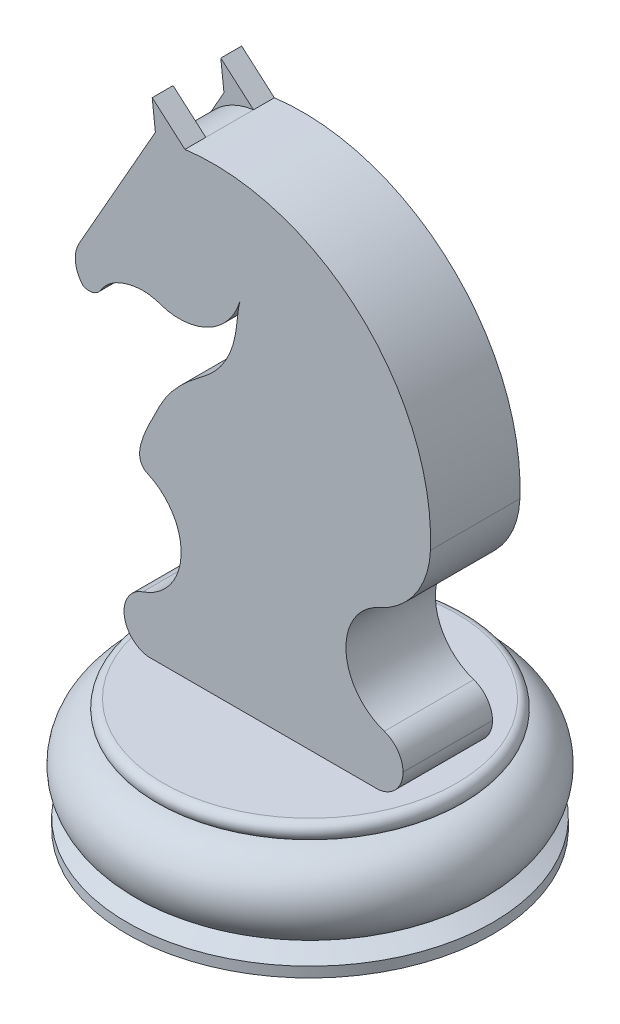
ISO-10303-21;
HEADER;
FILE_DESCRIPTION(('STEP AP214'),'2;1');
FILE_NAME('part.step','',(''),(''),'','','');
FILE_SCHEMA(('AUTOMOTIVE_DESIGN { 1 0 10303 214 1 1 1 1 }'));
ENDSEC;
DATA;
#1=APPLICATION_CONTEXT('core data for automotive mechanical design processes');
#2=APPLICATION_PROTOCOL_DEFINITION('international standard','automotive_design',2000,#1);
#3=PRODUCT_CONTEXT('',#1,'mechanical');
#4=PRODUCT('Part','Part','',(#3));
#5=PRODUCT_RELATED_PRODUCT_CATEGORY('part','',(#4));
#6=PRODUCT_DEFINITION_FORMATION('','',#4);
#7=PRODUCT_DEFINITION_CONTEXT('part definition',#1,'design');
#8=PRODUCT_DEFINITION('design','',#6,#7);
#9=PRODUCT_DEFINITION_SHAPE('','',#8);
#10=(LENGTH_UNIT() NAMED_UNIT(*) SI_UNIT(.MILLI.,.METRE.));
#11=(NAMED_UNIT(*) PLANE_ANGLE_UNIT() SI_UNIT($,.RADIAN.));
#12=(NAMED_UNIT(*) SI_UNIT($,.STERADIAN.) SOLID_ANGLE_UNIT());
#13=UNCERTAINTY_MEASURE_WITH_UNIT(LENGTH_MEASURE(1.E-05),#10,'distance_accuracy_value','');
#14=(GEOMETRIC_REPRESENTATION_CONTEXT(3) GLOBAL_UNCERTAINTY_ASSIGNED_CONTEXT((#13)) GLOBAL_UNIT_ASSIGNED_CONTEXT((#10,
#11,#12)) REPRESENTATION_CONTEXT('',''));
#15=CARTESIAN_POINT('',(0.,0.,0.));
#16=DIRECTION('',(0.,0.,1.));
#17=DIRECTION('',(1.,0.,0.));
#18=AXIS2_PLACEMENT_3D('',#15,#16,#17);
#19=CARTESIAN_POINT('',(-6.33453149086693,-9.76887763521636,3.8099981885137));
#20=DIRECTION('',(0.,0.,1.));
#21=DIRECTION('',(1.,0.,0.));
#22=AXIS2_PLACEMENT_3D('',#19,#20,#21);
#23=PLANE('',#22);
#24=CARTESIAN_POINT('',(-3.50659731221939,-7.43207763521636,3.8099981885137));
#25=DIRECTION('',(0.,0.,1.));
#26=DIRECTION('',(1.,0.,0.));
#27=AXIS2_PLACEMENT_3D('',#24,#25,#26);
#28=CIRCLE('',#27,2.3368);
#29=CARTESIAN_POINT('',(-5.84339731221939,-7.43207763521636,3.8099981885137));
#30=VERTEX_POINT('',#29);
#31=CARTESIAN_POINT('',(-3.77337090500808,-9.7536,3.8099981885137));
#32=VERTEX_POINT('',#31);
#33=EDGE_CURVE('E225',#30,#32,#28,.T.);
#34=ORIENTED_EDGE('',*,*,#33,.T.);
#35=DIRECTION('',(1.,0.,0.));
#36=VECTOR('',#35,1.);
#37=CARTESIAN_POINT('',(-6.33453149086693,-9.7536,3.8099981885137));
#38=LINE('',#37,#36);
#39=CARTESIAN_POINT('',(15.8487178428069,-9.7536,3.8099981885137));
#40=VERTEX_POINT('',#39);
#41=EDGE_CURVE('E54',#32,#40,#38,.T.);
#42=ORIENTED_EDGE('',*,*,#41,.T.);
#43=CARTESIAN_POINT('',(15.5819442500182,-7.43207763521637,3.8099981885137));
#44=DIRECTION('',(0.,0.,1.));
#45=DIRECTION('',(1.,0.,0.));
#46=AXIS2_PLACEMENT_3D('',#43,#44,#45);
#47=CIRCLE('',#46,2.3368);
#48=CARTESIAN_POINT('',(17.9187442500182,-7.43207763521637,3.8099981885137));
#49=VERTEX_POINT('',#48);
#50=EDGE_CURVE('E228',#40,#49,#47,.T.);
#51=ORIENTED_EDGE('',*,*,#50,.T.);
#52=DIRECTION('',(0.,-1.,0.));
#53=VECTOR('',#52,1.);
#54=CARTESIAN_POINT('',(17.9187442500182,-9.76887763521636,3.8099981885137));
#55=LINE('',#54,#53);
#56=CARTESIAN_POINT('',(17.9187442500182,-7.41737637676181,3.8099981885137));
#57=VERTEX_POINT('',#56);
#58=EDGE_CURVE('E416',#57,#49,#55,.T.);
#59=ORIENTED_EDGE('',*,*,#58,.F.);
#60=CARTESIAN_POINT('',(15.5819442500182,-7.41737637676181,3.8099981885137));
#61=DIRECTION('',(0.,0.,1.));
#62=DIRECTION('',(1.,0.,0.));
#63=AXIS2_PLACEMENT_3D('',#60,#61,#62);
#64=CIRCLE('',#63,2.3368);
#65=CARTESIAN_POINT('',(16.3236122403076,-5.20139739848153,3.8099981885137));
#66=VERTEX_POINT('',#65);
#67=EDGE_CURVE('E61',#57,#66,#64,.T.);
#68=ORIENTED_EDGE('',*,*,#67,.T.);
#69=CARTESIAN_POINT('',(17.8433961404727,-0.66053919994882,3.8099981885137));
#70=DIRECTION('',(0.,0.,1.));
#71=DIRECTION('',(1.,0.,0.));
#72=AXIS2_PLACEMENT_3D('',#69,#70,#71);
#73=CIRCLE('',#72,4.7884377705451);
#74=CARTESIAN_POINT('',(15.9068794115736,3.7188487985136,3.8099981885137));
#75=VERTEX_POINT('',#74);
#76=EDGE_CURVE('E419',#75,#66,#73,.T.);
#77=ORIENTED_EDGE('',*,*,#76,.F.);
#78=CARTESIAN_POINT('',(12.9491420458794,10.4077037557791,3.8099981885137));
#79=DIRECTION('',(0.,0.,1.));
#80=DIRECTION('',(1.,0.,0.));
#81=AXIS2_PLACEMENT_3D('',#78,#79,#80);
#82=CIRCLE('',#81,7.31361681822054);
#83=CARTESIAN_POINT('',(20.2569241723652,10.115622678725,3.8099981885137));
#84=VERTEX_POINT('',#83);
#85=EDGE_CURVE('E276',#75,#84,#82,.T.);
#86=ORIENTED_EDGE('',*,*,#85,.T.);
#87=CARTESIAN_POINT('',(1.73998635555858,10.8557168752493,3.8099981885137));
#88=DIRECTION('',(0.,0.,1.));
#89=DIRECTION('',(1.,0.,0.));
#90=AXIS2_PLACEMENT_3D('',#87,#88,#89);
#91=CIRCLE('',#90,18.5317221415392);
#92=CARTESIAN_POINT('',(-0.659397845841418,29.2314530777879,3.8099981885137));
#93=VERTEX_POINT('',#92);
#94=EDGE_CURVE('E488',#84,#93,#91,.T.);
#95=ORIENTED_EDGE('',*,*,#94,.T.);
#96=DIRECTION('',(0.754371000372789,-0.656448317688878,0.));
#97=VECTOR('',#96,1.);
#98=CARTESIAN_POINT('',(15.424203195965,15.2356170222457,3.8099981885137));
#99=LINE('',#98,#97);
#100=CARTESIAN_POINT('',(-3.44575324010753,31.6561198666032,3.8099981885137));
#101=VERTEX_POINT('',#100);
#102=EDGE_CURVE('E390',#101,#93,#99,.T.);
#103=ORIENTED_EDGE('',*,*,#102,.F.);
#104=DIRECTION('',(-0.110652575715223,0.993859148716551,0.));
#105=VECTOR('',#104,1.);
#106=CARTESIAN_POINT('',(1.07451092548524,-8.94398244960438,3.8099981885137));
#107=LINE('',#106,#105);
#108=CARTESIAN_POINT('',(-3.17597399240266,29.2330169995231,3.8099981885137));
#109=VERTEX_POINT('',#108);
#110=EDGE_CURVE('E392',#109,#101,#107,.T.);
#111=ORIENTED_EDGE('',*,*,#110,.F.);
#112=DIRECTION('',(-0.49379733980778,-0.869577016254892,0.));
#113=VECTOR('',#112,1.);
#114=CARTESIAN_POINT('',(-20.6933548516595,-1.61508717641833,3.8099981885137));
#115=LINE('',#114,#113);
#116=CARTESIAN_POINT('',(-9.6665667032036,17.8030845390098,3.8099981885137));
#117=VERTEX_POINT('',#116);
#118=EDGE_CURVE('E795',#109,#117,#115,.T.);
#119=ORIENTED_EDGE('',*,*,#118,.T.);
#120=CARTESIAN_POINT('',(-7.45784108191618,16.5488392958981,3.8099981885137));
#121=DIRECTION('',(0.,0.,1.));
#122=DIRECTION('',(1.,0.,0.));
#123=AXIS2_PLACEMENT_3D('',#120,#121,#122);
#124=CIRCLE('',#123,2.54);
#125=CARTESIAN_POINT('',(-9.34660634828971,14.8505561132277,3.8099981885137));
#126=VERTEX_POINT('',#125);
#127=EDGE_CURVE('E471',#117,#126,#124,.T.);
#128=ORIENTED_EDGE('',*,*,#127,.T.);
#129=CARTESIAN_POINT('',(-8.80866678794483,15.8359433472275,3.8099981885137));
#130=DIRECTION('',(0.,0.,1.));
#131=DIRECTION('',(1.,0.,0.));
#132=AXIS2_PLACEMENT_3D('',#129,#130,#131);
#133=CIRCLE('',#132,1.1226606662361);
#134=CARTESIAN_POINT('',(-7.85351560724268,15.245983015072,3.8099981885137));
#135=VERTEX_POINT('',#134);
#136=EDGE_CURVE('E446',#126,#135,#133,.T.);
#137=ORIENTED_EDGE('',*,*,#136,.T.);
#138=CARTESIAN_POINT('',(-2.14506856348728,16.5854049943185,3.8099981885137));
#139=CARTESIAN_POINT('',(-3.28798796014853,16.9835188620566,3.8099981885137));
#140=CARTESIAN_POINT('',(-4.47320990910234,17.1770517987488,3.8099981885137));
#141=CARTESIAN_POINT('',(-6.69690390961328,16.5653731211122,3.8099981885137));
#142=CARTESIAN_POINT('',(-7.57829909101477,15.6666016366963,3.8099981885137));
#143=CARTESIAN_POINT('',(-7.85351560724268,15.245983015072,3.8099981885137));
#144=B_SPLINE_CURVE_WITH_KNOTS('',3,(#138,#139,#140,#141,#142,#143),.UNSPECIFIED.,.F.,.F.,(4,1,
1,4),(0.,0.420129132468444,0.756704517434695,1.),.UNSPECIFIED.);
#145=CARTESIAN_POINT('',(-2.14506856348728,16.5854049943185,3.8099981885137));
#146=VERTEX_POINT('',#145);
#147=EDGE_CURVE('E281',#146,#135,#144,.T.);
#148=ORIENTED_EDGE('',*,*,#147,.F.);
#149=CARTESIAN_POINT('',(-1.16136412184366,21.9081442049396,3.8099981885137));
#150=DIRECTION('',(0.,0.,1.));
#151=DIRECTION('',(1.,0.,0.));
#152=AXIS2_PLACEMENT_3D('',#149,#150,#151);
#153=CIRCLE('',#152,5.41287605001198);
#154=CARTESIAN_POINT('',(4.03413064956451,20.3895721081778,3.8099981885137));
#155=VERTEX_POINT('',#154);
#156=EDGE_CURVE('E287',#146,#155,#153,.T.);
#157=ORIENTED_EDGE('',*,*,#156,.T.);
#158=CARTESIAN_POINT('',(4.03413064956451,20.3895721081778,3.8099981885137));
#159=CARTESIAN_POINT('',(3.82597931671066,19.6733321363585,3.8099981885137));
#160=CARTESIAN_POINT('',(3.78993160385629,18.0173628837938,3.8099981885137));
#161=CARTESIAN_POINT('',(3.14407513275843,15.7355854540321,3.8099981885137));
#162=CARTESIAN_POINT('',(1.80400348675601,13.8748530141868,3.8099981885137));
#163=CARTESIAN_POINT('',(-0.268432878015737,12.4439881665125,3.8099981885137));
#164=CARTESIAN_POINT('',(-2.18167142394436,10.5284495627718,3.8099981885137));
#165=CARTESIAN_POINT('',(-3.50693723533912,7.83245563451061,3.8099981885137));
#166=CARTESIAN_POINT('',(-5.25642056989235,4.34891848768243,3.8099981885137));
#167=CARTESIAN_POINT('',(-3.83153247377478,3.71884879851359,3.8099981885137));
#168=B_SPLINE_CURVE_WITH_KNOTS('',3,(#158,#159,#160,#161,#162,#163,#164,#165,#166,#167),
.UNSPECIFIED.,.F.,.F.,(4,1,1,1,1,1,1,4),(0.,0.124569175441424,0.243621952632296,
0.370064102740452,0.470537717841571,0.638822979124148,0.769534636035511,1.),.UNSPECIFIED.);
#169=CARTESIAN_POINT('',(-3.83153247377477,3.71884879851359,3.8099981885137));
#170=VERTEX_POINT('',#169);
#171=EDGE_CURVE('E251',#155,#170,#168,.T.);
#172=ORIENTED_EDGE('',*,*,#171,.T.);
#173=CARTESIAN_POINT('',(-5.76804920267394,-0.660539199948825,3.8099981885137));
#174=DIRECTION('',(0.,0.,1.));
#175=DIRECTION('',(1.,0.,0.));
#176=AXIS2_PLACEMENT_3D('',#173,#174,#175);
#177=CIRCLE('',#176,4.78843777054511);
#178=CARTESIAN_POINT('',(-4.24826530250877,-5.20139739848154,3.8099981885137));
#179=VERTEX_POINT('',#178);
#180=EDGE_CURVE('E243',#170,#179,#177,.F.);
#181=ORIENTED_EDGE('',*,*,#180,.T.);
#182=CARTESIAN_POINT('',(-3.50659731221939,-7.41737637676182,3.8099981885137));
#183=DIRECTION('',(0.,0.,1.));
#184=DIRECTION('',(1.,0.,0.));
#185=AXIS2_PLACEMENT_3D('',#182,#183,#184);
#186=CIRCLE('',#185,2.3368);
#187=CARTESIAN_POINT('',(-5.84339731221939,-7.41737637676182,3.8099981885137));
#188=VERTEX_POINT('',#187);
#189=EDGE_CURVE('E223',#179,#188,#186,.T.);
#190=ORIENTED_EDGE('',*,*,#189,.T.);
#191=DIRECTION('',(0.,-1.,0.));
#192=VECTOR('',#191,1.);
#193=CARTESIAN_POINT('',(-5.84339731221939,-9.76887763521636,3.8099981885137));
#194=LINE('',#193,#192);
#195=EDGE_CURVE('E253',#188,#30,#194,.T.);
#196=ORIENTED_EDGE('',*,*,#195,.T.);
#197=EDGE_LOOP('',(#34,#42,#51,#59,#68,#77,#86,#95,#103,#111,#119,#128,#137,#148,#157,#172,#181,
#190,#196));
#198=FACE_BOUND('',#197,.T.);
#199=ADVANCED_FACE('F39',(#198),#23,.T.);
#200=CARTESIAN_POINT('',(-6.33453149086693,-9.76887763521636,-3.8100018114863));
#201=DIRECTION('',(0.,0.,1.));
#202=DIRECTION('',(1.,0.,0.));
#203=AXIS2_PLACEMENT_3D('',#200,#201,#202);
#204=PLANE('',#203);
#205=DIRECTION('',(1.,0.,0.));
#206=VECTOR('',#205,1.);
#207=CARTESIAN_POINT('',(-6.33453149086693,-9.7536,-3.8100018114863));
#208=LINE('',#207,#206);
#209=CARTESIAN_POINT('',(-3.77337090500808,-9.7536,-3.8100018114863));
#210=VERTEX_POINT('',#209);
#211=CARTESIAN_POINT('',(15.8487178428069,-9.7536,-3.8100018114863));
#212=VERTEX_POINT('',#211);
#213=EDGE_CURVE('E195',#210,#212,#208,.T.);
#214=ORIENTED_EDGE('',*,*,#213,.F.);
#215=CARTESIAN_POINT('',(-3.50659731221939,-7.43207763521636,-3.8100018114863));
#216=DIRECTION('',(0.,0.,1.));
#217=DIRECTION('',(1.,0.,0.));
#218=AXIS2_PLACEMENT_3D('',#215,#216,#217);
#219=CIRCLE('',#218,2.3368);
#220=CARTESIAN_POINT('',(-5.84339731221939,-7.43207763521636,-3.8100018114863));
#221=VERTEX_POINT('',#220);
#222=EDGE_CURVE('E205',#210,#221,#219,.F.);
#223=ORIENTED_EDGE('',*,*,#222,.T.);
#224=DIRECTION('',(0.,-1.,0.));
#225=VECTOR('',#224,1.);
#226=CARTESIAN_POINT('',(-5.84339731221939,-9.76887763521636,-3.8100018114863));
#227=LINE('',#226,#225);
#228=CARTESIAN_POINT('',(-5.84339731221939,-7.41737637676182,-3.8100018114863));
#229=VERTEX_POINT('',#228);
#230=EDGE_CURVE('E258',#229,#221,#227,.T.);
#231=ORIENTED_EDGE('',*,*,#230,.F.);
#232=CARTESIAN_POINT('',(-3.50659731221939,-7.41737637676182,-3.8100018114863));
#233=DIRECTION('',(0.,0.,1.));
#234=DIRECTION('',(1.,0.,0.));
#235=AXIS2_PLACEMENT_3D('',#232,#233,#234);
#236=CIRCLE('',#235,2.3368);
#237=CARTESIAN_POINT('',(-4.24826530250877,-5.20139739848154,-3.8100018114863));
#238=VERTEX_POINT('',#237);
#239=EDGE_CURVE('E215',#229,#238,#236,.F.);
#240=ORIENTED_EDGE('',*,*,#239,.T.);
#241=CARTESIAN_POINT('',(-5.76804920267394,-0.660539199948825,-3.8100018114863));
#242=DIRECTION('',(0.,0.,1.));
#243=DIRECTION('',(1.,0.,0.));
#244=AXIS2_PLACEMENT_3D('',#241,#242,#243);
#245=CIRCLE('',#244,4.78843777054511);
#246=CARTESIAN_POINT('',(-3.83153247377477,3.71884879851359,-3.8100018114863));
#247=VERTEX_POINT('',#246);
#248=EDGE_CURVE('E245',#247,#238,#245,.F.);
#249=ORIENTED_EDGE('',*,*,#248,.F.);
#250=CARTESIAN_POINT('',(4.03413064956451,20.3895721081778,-3.8100018114863));
#251=CARTESIAN_POINT('',(3.82597931671066,19.6733321363585,-3.8100018114863));
#252=CARTESIAN_POINT('',(3.78993160385629,18.0173628837938,-3.8100018114863));
#253=CARTESIAN_POINT('',(3.14407513275843,15.7355854540321,-3.8100018114863));
#254=CARTESIAN_POINT('',(1.80400348675601,13.8748530141868,-3.8100018114863));
#255=CARTESIAN_POINT('',(-0.268432878015737,12.4439881665125,-3.8100018114863));
#256=CARTESIAN_POINT('',(-2.18167142394436,10.5284495627718,-3.8100018114863));
#257=CARTESIAN_POINT('',(-3.50693723533912,7.83245563451061,-3.8100018114863));
#258=CARTESIAN_POINT('',(-5.25642056989235,4.34891848768243,-3.8100018114863));
#259=CARTESIAN_POINT('',(-3.83153247377478,3.71884879851359,-3.8100018114863));
#260=B_SPLINE_CURVE_WITH_KNOTS('',3,(#250,#251,#252,#253,#254,#255,#256,#257,#258,#259),
.UNSPECIFIED.,.F.,.F.,(4,1,1,1,1,1,1,4),(0.,0.124569175441424,0.243621952632296,
0.370064102740452,0.470537717841571,0.638822979124148,0.769534636035511,1.),.UNSPECIFIED.);
#261=CARTESIAN_POINT('',(4.03413064956451,20.3895721081778,-3.8100018114863));
#262=VERTEX_POINT('',#261);
#263=EDGE_CURVE('E263',#262,#247,#260,.T.);
#264=ORIENTED_EDGE('',*,*,#263,.F.);
#265=CARTESIAN_POINT('',(-1.16136412184366,21.9081442049396,-3.8100018114863));
#266=DIRECTION('',(0.,0.,1.));
#267=DIRECTION('',(1.,0.,0.));
#268=AXIS2_PLACEMENT_3D('',#265,#266,#267);
#269=CIRCLE('',#268,5.41287605001198);
#270=CARTESIAN_POINT('',(-2.14506856348728,16.5854049943185,-3.8100018114863));
#271=VERTEX_POINT('',#270);
#272=EDGE_CURVE('E356',#271,#262,#269,.T.);
#273=ORIENTED_EDGE('',*,*,#272,.F.);
#274=CARTESIAN_POINT('',(-2.14506856348728,16.5854049943185,-3.8100018114863));
#275=CARTESIAN_POINT('',(-3.28798796014853,16.9835188620566,-3.8100018114863));
#276=CARTESIAN_POINT('',(-4.47320990910234,17.1770517987488,-3.8100018114863));
#277=CARTESIAN_POINT('',(-6.69690390961328,16.5653731211122,-3.8100018114863));
#278=CARTESIAN_POINT('',(-7.57829909101477,15.6666016366963,-3.8100018114863));
#279=CARTESIAN_POINT('',(-7.85351560724268,15.245983015072,-3.8100018114863));
#280=B_SPLINE_CURVE_WITH_KNOTS('',3,(#274,#275,#276,#277,#278,#279),.UNSPECIFIED.,.F.,.F.,(4,1,
1,4),(0.,0.420129132468444,0.756704517434695,1.),.UNSPECIFIED.);
#281=CARTESIAN_POINT('',(-7.85351560724268,15.245983015072,-3.8100018114863));
#282=VERTEX_POINT('',#281);
#283=EDGE_CURVE('E280',#271,#282,#280,.T.);
#284=ORIENTED_EDGE('',*,*,#283,.T.);
#285=CARTESIAN_POINT('',(-8.80866678794483,15.8359433472275,-3.8100018114863));
#286=DIRECTION('',(0.,0.,1.));
#287=DIRECTION('',(1.,0.,0.));
#288=AXIS2_PLACEMENT_3D('',#285,#286,#287);
#289=CIRCLE('',#288,1.1226606662361);
#290=CARTESIAN_POINT('',(-9.34660634828971,14.8505561132277,-3.8100018114863));
#291=VERTEX_POINT('',#290);
#292=EDGE_CURVE('E288',#291,#282,#289,.T.);
#293=ORIENTED_EDGE('',*,*,#292,.F.);
#294=CARTESIAN_POINT('',(-7.45784108191618,16.5488392958981,-3.8100018114863));
#295=DIRECTION('',(0.,0.,1.));
#296=DIRECTION('',(1.,0.,0.));
#297=AXIS2_PLACEMENT_3D('',#294,#295,#296);
#298=CIRCLE('',#297,2.54);
#299=CARTESIAN_POINT('',(-9.66656670320359,17.8030845390098,-3.8100018114863));
#300=VERTEX_POINT('',#299);
#301=EDGE_CURVE('E467',#291,#300,#298,.F.);
#302=ORIENTED_EDGE('',*,*,#301,.T.);
#303=DIRECTION('',(-0.49379733980778,-0.869577016254892,0.));
#304=VECTOR('',#303,1.);
#305=CARTESIAN_POINT('',(-20.6933548516595,-1.61508717641833,-3.8100018114863));
#306=LINE('',#305,#304);
#307=CARTESIAN_POINT('',(-3.17597399240266,29.2330169995231,-3.8100018114863));
#308=VERTEX_POINT('',#307);
#309=EDGE_CURVE('E355',#308,#300,#306,.T.);
#310=ORIENTED_EDGE('',*,*,#309,.F.);
#311=DIRECTION('',(0.110652575715223,-0.993859148716551,0.));
#312=VECTOR('',#311,1.);
#313=CARTESIAN_POINT('',(-3.17597399240266,29.2330169995231,-3.8100018114863));
#314=LINE('',#313,#312);
#315=CARTESIAN_POINT('',(-3.44575324010753,31.6561198666032,-3.8100018114863));
#316=VERTEX_POINT('',#315);
#317=EDGE_CURVE('E367',#316,#308,#314,.T.);
#318=ORIENTED_EDGE('',*,*,#317,.F.);
#319=DIRECTION('',(-0.754371000372789,0.656448317688878,0.));
#320=VECTOR('',#319,1.);
#321=CARTESIAN_POINT('',(-3.44575324010753,31.6561198666032,-3.8100018114863));
#322=LINE('',#321,#320);
#323=CARTESIAN_POINT('',(-0.659397845841418,29.2314530777879,-3.8100018114863));
#324=VERTEX_POINT('',#323);
#325=EDGE_CURVE('E362',#324,#316,#322,.T.);
#326=ORIENTED_EDGE('',*,*,#325,.F.);
#327=CARTESIAN_POINT('',(1.73998635555858,10.8557168752493,-3.8100018114863));
#328=DIRECTION('',(0.,0.,1.));
#329=DIRECTION('',(1.,0.,0.));
#330=AXIS2_PLACEMENT_3D('',#327,#328,#329);
#331=CIRCLE('',#330,18.5317221415392);
#332=CARTESIAN_POINT('',(20.2569241723652,10.115622678725,-3.8100018114863));
#333=VERTEX_POINT('',#332);
#334=EDGE_CURVE('E347',#333,#324,#331,.T.);
#335=ORIENTED_EDGE('',*,*,#334,.F.);
#336=CARTESIAN_POINT('',(12.9491420458794,10.4077037557791,-3.8100018114863));
#337=DIRECTION('',(0.,0.,1.));
#338=DIRECTION('',(1.,0.,0.));
#339=AXIS2_PLACEMENT_3D('',#336,#337,#338);
#340=CIRCLE('',#339,7.31361681822054);
#341=CARTESIAN_POINT('',(15.9068794115736,3.7188487985136,-3.8100018114863));
#342=VERTEX_POINT('',#341);
#343=EDGE_CURVE('E269',#342,#333,#340,.T.);
#344=ORIENTED_EDGE('',*,*,#343,.F.);
#345=CARTESIAN_POINT('',(17.8433961404727,-0.66053919994882,-3.8100018114863));
#346=DIRECTION('',(0.,0.,1.));
#347=DIRECTION('',(1.,0.,0.));
#348=AXIS2_PLACEMENT_3D('',#345,#346,#347);
#349=CIRCLE('',#348,4.7884377705451);
#350=CARTESIAN_POINT('',(16.3236122403076,-5.20139739848153,-3.8100018114863));
#351=VERTEX_POINT('',#350);
#352=EDGE_CURVE('E261',#342,#351,#349,.T.);
#353=ORIENTED_EDGE('',*,*,#352,.T.);
#354=CARTESIAN_POINT('',(15.5819442500182,-7.41737637676181,-3.8100018114863));
#355=DIRECTION('',(0.,0.,1.));
#356=DIRECTION('',(1.,0.,0.));
#357=AXIS2_PLACEMENT_3D('',#354,#355,#356);
#358=CIRCLE('',#357,2.3368);
#359=CARTESIAN_POINT('',(17.9187442500182,-7.41737637676181,-3.8100018114863));
#360=VERTEX_POINT('',#359);
#361=EDGE_CURVE('E214',#351,#360,#358,.F.);
#362=ORIENTED_EDGE('',*,*,#361,.T.);
#363=DIRECTION('',(0.,-1.,0.));
#364=VECTOR('',#363,1.);
#365=CARTESIAN_POINT('',(17.9187442500182,-9.76887763521636,-3.8100018114863));
#366=LINE('',#365,#364);
#367=CARTESIAN_POINT('',(17.9187442500182,-7.43207763521637,-3.8100018114863));
#368=VERTEX_POINT('',#367);
#369=EDGE_CURVE('E259',#360,#368,#366,.T.);
#370=ORIENTED_EDGE('',*,*,#369,.T.);
#371=CARTESIAN_POINT('',(15.5819442500182,-7.43207763521637,-3.8100018114863));
#372=DIRECTION('',(0.,0.,1.));
#373=DIRECTION('',(1.,0.,0.));
#374=AXIS2_PLACEMENT_3D('',#371,#372,#373);
#375=CIRCLE('',#374,2.3368);
#376=EDGE_CURVE('E208',#368,#212,#375,.F.);
#377=ORIENTED_EDGE('',*,*,#376,.T.);
#378=EDGE_LOOP('',(#214,#223,#231,#240,#249,#264,#273,#284,#293,#302,#310,#318,#326,#335,#344,
#353,#362,#370,#377));
#379=FACE_BOUND('',#378,.T.);
#380=ADVANCED_FACE('F203',(#379),#204,.F.);
#381=CARTESIAN_POINT('',(15.5819442500182,-7.43207763521637,3.8099981885137));
#382=DIRECTION('',(0.,0.,1.));
#383=DIRECTION('',(1.,0.,0.));
#384=AXIS2_PLACEMENT_3D('',#381,#382,#383);
#385=CYLINDRICAL_SURFACE('',#384,2.3368);
#386=ORIENTED_EDGE('',*,*,#50,.F.);
#387=DIRECTION('',(0.,0.,1.));
#388=VECTOR('',#387,1.);
#389=CARTESIAN_POINT('',(15.8487178428069,-9.7536,3.8099981885137));
#390=LINE('',#389,#388);
#391=EDGE_CURVE('E378',#40,#212,#390,.F.);
#392=ORIENTED_EDGE('',*,*,#391,.T.);
#393=ORIENTED_EDGE('',*,*,#376,.F.);
#394=DIRECTION('',(0.,0.,-1.));
#395=VECTOR('',#394,1.);
#396=CARTESIAN_POINT('',(17.9187442500182,-7.43207763521637,-3.8100018114863));
#397=LINE('',#396,#395);
#398=EDGE_CURVE('E218',#49,#368,#397,.T.);
#399=ORIENTED_EDGE('',*,*,#398,.F.);
#400=EDGE_LOOP('',(#386,#392,#393,#399));
#401=FACE_BOUND('',#400,.T.);
#402=ADVANCED_FACE('F308',(#401),#385,.T.);
#403=CARTESIAN_POINT('',(-3.50659731221939,-7.43207763521636,3.8099981885137));
#404=DIRECTION('',(0.,0.,-1.));
#405=DIRECTION('',(-1.,0.,0.));
#406=AXIS2_PLACEMENT_3D('',#403,#404,#405);
#407=CYLINDRICAL_SURFACE('',#406,2.3368);
#408=ORIENTED_EDGE('',*,*,#222,.F.);
#409=DIRECTION('',(0.,0.,-1.));
#410=VECTOR('',#409,1.);
#411=CARTESIAN_POINT('',(-3.77337090500808,-9.7536,3.8099981885137));
#412=LINE('',#411,#410);
#413=EDGE_CURVE('E11',#210,#32,#412,.F.);
#414=ORIENTED_EDGE('',*,*,#413,.T.);
#415=ORIENTED_EDGE('',*,*,#33,.F.);
#416=DIRECTION('',(0.,0.,-1.));
#417=VECTOR('',#416,1.);
#418=CARTESIAN_POINT('',(-5.84339731221939,-7.43207763521636,3.8099981885137));
#419=LINE('',#418,#417);
#420=EDGE_CURVE('E213',#221,#30,#419,.F.);
#421=ORIENTED_EDGE('',*,*,#420,.F.);
#422=EDGE_LOOP('',(#408,#414,#415,#421));
#423=FACE_BOUND('',#422,.T.);
#424=ADVANCED_FACE('F212',(#423),#407,.T.);
#425=CARTESIAN_POINT('',(0.0793191794338424,23.5739726389062,3.8099981885137));
#426=DIRECTION('',(0.,0.,-1.));
#427=DIRECTION('',(-1.,0.,0.));
#428=AXIS2_PLACEMENT_3D('',#425,#426,#427);
#429=CYLINDRICAL_SURFACE('',#428,5.70550503985055);
#430=DIRECTION('',(0.,0.,-1.));
#431=VECTOR('',#430,1.);
#432=CARTESIAN_POINT('',(-0.659397845841418,29.2314530777879,3.8099981885137));
#433=LINE('',#432,#431);
#434=CARTESIAN_POINT('',(-0.659397845841418,29.2314530777879,2.0319981885137));
#435=VERTEX_POINT('',#434);
#436=CARTESIAN_POINT('',(-0.659397845841418,29.2314530777879,-2.03200181148629));
#437=VERTEX_POINT('',#436);
#438=EDGE_CURVE('E462',#435,#437,#433,.T.);
#439=ORIENTED_EDGE('',*,*,#438,.T.);
#440=CARTESIAN_POINT('',(0.0793191794338424,23.5739726389062,-2.0320018114863));
#441=DIRECTION('',(0.,0.,-1.));
#442=DIRECTION('',(1.,0.,0.));
#443=AXIS2_PLACEMENT_3D('',#440,#441,#442);
#444=CIRCLE('',#443,5.70550503985055);
#445=CARTESIAN_POINT('',(-4.34100322784567,27.1814007498272,-2.03200181148629));
#446=VERTEX_POINT('',#445);
#447=EDGE_CURVE('E381',#446,#437,#444,.T.);
#448=ORIENTED_EDGE('',*,*,#447,.F.);
#449=DIRECTION('',(0.,0.,-1.));
#450=VECTOR('',#449,1.);
#451=CARTESIAN_POINT('',(-4.34100322784567,27.1814007498272,3.8099981885137));
#452=LINE('',#451,#450);
#453=CARTESIAN_POINT('',(-4.34100322784567,27.1814007498272,2.0319981885137));
#454=VERTEX_POINT('',#453);
#455=EDGE_CURVE('E459',#454,#446,#452,.T.);
#456=ORIENTED_EDGE('',*,*,#455,.F.);
#457=CARTESIAN_POINT('',(0.0793191794338424,23.5739726389062,2.0319981885137));
#458=DIRECTION('',(0.,0.,1.));
#459=DIRECTION('',(1.,0.,0.));
#460=AXIS2_PLACEMENT_3D('',#457,#458,#459);
#461=CIRCLE('',#460,5.70550503985055);
#462=EDGE_CURVE('E388',#435,#454,#461,.T.);
#463=ORIENTED_EDGE('',*,*,#462,.F.);
#464=EDGE_LOOP('',(#439,#448,#456,#463));
#465=FACE_BOUND('',#464,.T.);
#466=ADVANCED_FACE('F299',(#465),#429,.T.);
#467=DIRECTION('',(0.,0.,-1.));
#468=VECTOR('',#467,1.);
#469=SURFACE_OF_LINEAR_EXTRUSION('',#144,#468);
#470=ORIENTED_EDGE('',*,*,#283,.F.);
#471=DIRECTION('',(0.,0.,-1.));
#472=VECTOR('',#471,1.);
#473=CARTESIAN_POINT('',(-2.14506856348728,16.5854049943185,3.8099981885137));
#474=LINE('',#473,#472);
#475=EDGE_CURVE('E437',#146,#271,#474,.T.);
#476=ORIENTED_EDGE('',*,*,#475,.F.);
#477=ORIENTED_EDGE('',*,*,#147,.T.);
#478=DIRECTION('',(0.,0.,-1.));
#479=VECTOR('',#478,1.);
#480=CARTESIAN_POINT('',(-7.85351560724268,15.245983015072,3.8099981885137));
#481=LINE('',#480,#479);
#482=EDGE_CURVE('E440',#135,#282,#481,.T.);
#483=ORIENTED_EDGE('',*,*,#482,.T.);
#484=EDGE_LOOP('',(#470,#476,#477,#483));
#485=FACE_BOUND('',#484,.T.);
#486=ADVANCED_FACE('F294',(#485),#469,.T.);
#487=CARTESIAN_POINT('',(-1.16136412184366,21.9081442049396,3.8099981885137));
#488=DIRECTION('',(0.,0.,-1.));
#489=DIRECTION('',(-1.,0.,0.));
#490=AXIS2_PLACEMENT_3D('',#487,#488,#489);
#491=CYLINDRICAL_SURFACE('',#490,5.41287605001198);
#492=ORIENTED_EDGE('',*,*,#272,.T.);
#493=DIRECTION('',(0.,0.,-1.));
#494=VECTOR('',#493,1.);
#495=CARTESIAN_POINT('',(4.03413064956451,20.3895721081778,3.8099981885137));
#496=LINE('',#495,#494);
#497=EDGE_CURVE('E431',#155,#262,#496,.T.);
#498=ORIENTED_EDGE('',*,*,#497,.F.);
#499=ORIENTED_EDGE('',*,*,#156,.F.);
#500=ORIENTED_EDGE('',*,*,#475,.T.);
#501=EDGE_LOOP('',(#492,#498,#499,#500));
#502=FACE_BOUND('',#501,.T.);
#503=ADVANCED_FACE('F298',(#502),#491,.T.);
#504=CARTESIAN_POINT('',(1.73998635555858,10.8557168752493,3.8099981885137));
#505=DIRECTION('',(0.,0.,-1.));
#506=DIRECTION('',(-1.,0.,0.));
#507=AXIS2_PLACEMENT_3D('',#504,#505,#506);
#508=CYLINDRICAL_SURFACE('',#507,18.5317221415392);
#509=ORIENTED_EDGE('',*,*,#334,.T.);
#510=DIRECTION('',(0.,0.,1.));
#511=VECTOR('',#510,1.);
#512=CARTESIAN_POINT('',(-0.65939784584142,29.2314530777879,-3.8100018114863));
#513=LINE('',#512,#511);
#514=EDGE_CURVE('E350',#324,#437,#513,.T.);
#515=ORIENTED_EDGE('',*,*,#514,.T.);
#516=ORIENTED_EDGE('',*,*,#438,.F.);
#517=EDGE_CURVE('E463',#93,#435,#433,.T.);
#518=ORIENTED_EDGE('',*,*,#517,.F.);
#519=ORIENTED_EDGE('',*,*,#94,.F.);
#520=DIRECTION('',(0.,0.,-1.));
#521=VECTOR('',#520,1.);
#522=CARTESIAN_POINT('',(20.2569241723652,10.115622678725,3.8099981885137));
#523=LINE('',#522,#521);
#524=EDGE_CURVE('E272',#84,#333,#523,.T.);
#525=ORIENTED_EDGE('',*,*,#524,.T.);
#526=EDGE_LOOP('',(#509,#515,#516,#518,#519,#525));
#527=FACE_BOUND('',#526,.T.);
#528=ADVANCED_FACE('F339',(#527),#508,.T.);
#529=CARTESIAN_POINT('',(-20.6933548516595,-1.61508717641833,3.8099981885137));
#530=DIRECTION('',(0.869577016254892,-0.49379733980778,0.));
#531=DIRECTION('',(0.49379733980778,0.869577016254892,0.));
#532=AXIS2_PLACEMENT_3D('',#529,#530,#531);
#533=PLANE('',#532);
#534=ORIENTED_EDGE('',*,*,#309,.T.);
#535=DIRECTION('',(0.,0.,-1.));
#536=VECTOR('',#535,1.);
#537=CARTESIAN_POINT('',(-9.6665667032036,17.8030845390098,3.8099981885137));
#538=LINE('',#537,#536);
#539=EDGE_CURVE('E469',#300,#117,#538,.F.);
#540=ORIENTED_EDGE('',*,*,#539,.T.);
#541=ORIENTED_EDGE('',*,*,#118,.F.);
#542=DIRECTION('',(0.,0.,-1.));
#543=VECTOR('',#542,1.);
#544=CARTESIAN_POINT('',(-3.17597399240266,29.2330169995231,3.8099981885137));
#545=LINE('',#544,#543);
#546=CARTESIAN_POINT('',(-3.17597399240266,29.2330169995231,2.0319981885137));
#547=VERTEX_POINT('',#546);
#548=EDGE_CURVE('E396',#109,#547,#545,.T.);
#549=ORIENTED_EDGE('',*,*,#548,.T.);
#550=DIRECTION('',(-0.49379733980778,-0.869577016254892,0.));
#551=VECTOR('',#550,1.);
#552=CARTESIAN_POINT('',(-20.6933548516595,-1.61508717641833,2.0319981885137));
#553=LINE('',#552,#551);
#554=EDGE_CURVE('E393',#547,#454,#553,.T.);
#555=ORIENTED_EDGE('',*,*,#554,.T.);
#556=ORIENTED_EDGE('',*,*,#455,.T.);
#557=DIRECTION('',(-0.493797339807782,-0.86957701625489,0.));
#558=VECTOR('',#557,1.);
#559=CARTESIAN_POINT('',(-3.17597399240266,29.2330169995231,-2.0320018114863));
#560=LINE('',#559,#558);
#561=CARTESIAN_POINT('',(-3.17597399240266,29.2330169995231,-2.0320018114863));
#562=VERTEX_POINT('',#561);
#563=EDGE_CURVE('E371',#562,#446,#560,.T.);
#564=ORIENTED_EDGE('',*,*,#563,.F.);
#565=DIRECTION('',(0.,0.,1.));
#566=VECTOR('',#565,1.);
#567=CARTESIAN_POINT('',(-3.17597399240266,29.2330169995231,-3.8100018114863));
#568=LINE('',#567,#566);
#569=EDGE_CURVE('E386',#308,#562,#568,.T.);
#570=ORIENTED_EDGE('',*,*,#569,.F.);
#571=EDGE_LOOP('',(#534,#540,#541,#549,#555,#556,#564,#570));
#572=FACE_BOUND('',#571,.T.);
#573=ADVANCED_FACE('F336',(#572),#533,.F.);
#574=CARTESIAN_POINT('',(-8.80866678794483,15.8359433472275,3.8099981885137));
#575=DIRECTION('',(0.,0.,-1.));
#576=DIRECTION('',(-1.,0.,0.));
#577=AXIS2_PLACEMENT_3D('',#574,#575,#576);
#578=CYLINDRICAL_SURFACE('',#577,1.1226606662361);
#579=ORIENTED_EDGE('',*,*,#292,.T.);
#580=ORIENTED_EDGE('',*,*,#482,.F.);
#581=ORIENTED_EDGE('',*,*,#136,.F.);
#582=DIRECTION('',(0.,0.,-1.));
#583=VECTOR('',#582,1.);
#584=CARTESIAN_POINT('',(-9.34660634828971,14.8505561132277,3.8099981885137));
#585=LINE('',#584,#583);
#586=EDGE_CURVE('E456',#126,#291,#585,.T.);
#587=ORIENTED_EDGE('',*,*,#586,.T.);
#588=EDGE_LOOP('',(#579,#580,#581,#587));
#589=FACE_BOUND('',#588,.T.);
#590=ADVANCED_FACE('F333',(#589),#578,.T.);
#591=DIRECTION('',(0.,0.,-1.));
#592=VECTOR('',#591,1.);
#593=SURFACE_OF_LINEAR_EXTRUSION('',#168,#592);
#594=ORIENTED_EDGE('',*,*,#263,.T.);
#595=DIRECTION('',(0.,0.,-1.));
#596=VECTOR('',#595,1.);
#597=CARTESIAN_POINT('',(-3.83153247377477,3.71884879851359,3.8099981885137));
#598=LINE('',#597,#596);
#599=EDGE_CURVE('E278',#170,#247,#598,.T.);
#600=ORIENTED_EDGE('',*,*,#599,.F.);
#601=ORIENTED_EDGE('',*,*,#171,.F.);
#602=ORIENTED_EDGE('',*,*,#497,.T.);
#603=EDGE_LOOP('',(#594,#600,#601,#602));
#604=FACE_BOUND('',#603,.T.);
#605=ADVANCED_FACE('F329',(#604),#593,.F.);
#606=CARTESIAN_POINT('',(-5.76804920267394,-0.660539199948825,3.8099981885137));
#607=DIRECTION('',(0.,0.,-1.));
#608=DIRECTION('',(-1.,0.,0.));
#609=AXIS2_PLACEMENT_3D('',#606,#607,#608);
#610=CYLINDRICAL_SURFACE('',#609,4.78843777054511);
#611=ORIENTED_EDGE('',*,*,#248,.T.);
#612=DIRECTION('',(0.,0.,-1.));
#613=VECTOR('',#612,1.);
#614=CARTESIAN_POINT('',(-4.24826530250877,-5.20139739848154,3.8099981885137));
#615=LINE('',#614,#613);
#616=EDGE_CURVE('E47',#238,#179,#615,.F.);
#617=ORIENTED_EDGE('',*,*,#616,.T.);
#618=ORIENTED_EDGE('',*,*,#180,.F.);
#619=ORIENTED_EDGE('',*,*,#599,.T.);
#620=EDGE_LOOP('',(#611,#617,#618,#619));
#621=FACE_BOUND('',#620,.T.);
#622=ADVANCED_FACE('F241',(#621),#610,.F.);
#623=CARTESIAN_POINT('',(-5.84339731221939,-9.76887763521636,3.8099981885137));
#624=DIRECTION('',(1.,0.,0.));
#625=DIRECTION('',(0.,0.,-1.));
#626=AXIS2_PLACEMENT_3D('',#623,#624,#625);
#627=PLANE('',#626);
#628=ORIENTED_EDGE('',*,*,#230,.T.);
#629=ORIENTED_EDGE('',*,*,#420,.T.);
#630=ORIENTED_EDGE('',*,*,#195,.F.);
#631=DIRECTION('',(0.,0.,-1.));
#632=VECTOR('',#631,1.);
#633=CARTESIAN_POINT('',(-5.84339731221939,-7.41737637676182,3.8099981885137));
#634=LINE('',#633,#632);
#635=EDGE_CURVE('E233',#188,#229,#634,.T.);
#636=ORIENTED_EDGE('',*,*,#635,.T.);
#637=EDGE_LOOP('',(#628,#629,#630,#636));
#638=FACE_BOUND('',#637,.T.);
#639=ADVANCED_FACE('F257',(#638),#627,.F.);
#640=CARTESIAN_POINT('',(17.9187442500182,-9.76887763521636,3.8099981885137));
#641=DIRECTION('',(1.,0.,0.));
#642=DIRECTION('',(0.,0.,-1.));
#643=AXIS2_PLACEMENT_3D('',#640,#641,#642);
#644=PLANE('',#643);
#645=ORIENTED_EDGE('',*,*,#58,.T.);
#646=ORIENTED_EDGE('',*,*,#398,.T.);
#647=ORIENTED_EDGE('',*,*,#369,.F.);
#648=DIRECTION('',(0.,0.,-1.));
#649=VECTOR('',#648,1.);
#650=CARTESIAN_POINT('',(17.9187442500182,-7.41737637676181,3.8099981885137));
#651=LINE('',#650,#649);
#652=EDGE_CURVE('E473',#360,#57,#651,.F.);
#653=ORIENTED_EDGE('',*,*,#652,.T.);
#654=EDGE_LOOP('',(#645,#646,#647,#653));
#655=FACE_BOUND('',#654,.T.);
#656=ADVANCED_FACE('F478',(#655),#644,.T.);
#657=CARTESIAN_POINT('',(17.8433961404727,-0.66053919994882,3.8099981885137));
#658=DIRECTION('',(0.,0.,-1.));
#659=DIRECTION('',(-1.,0.,0.));
#660=AXIS2_PLACEMENT_3D('',#657,#658,#659);
#661=CYLINDRICAL_SURFACE('',#660,4.7884377705451);
#662=ORIENTED_EDGE('',*,*,#76,.T.);
#663=DIRECTION('',(0.,0.,-1.));
#664=VECTOR('',#663,1.);
#665=CARTESIAN_POINT('',(16.3236122403076,-5.20139739848153,3.8099981885137));
#666=LINE('',#665,#664);
#667=EDGE_CURVE('E230',#66,#351,#666,.T.);
#668=ORIENTED_EDGE('',*,*,#667,.T.);
#669=ORIENTED_EDGE('',*,*,#352,.F.);
#670=DIRECTION('',(0.,0.,-1.));
#671=VECTOR('',#670,1.);
#672=CARTESIAN_POINT('',(15.9068794115736,3.7188487985136,3.8099981885137));
#673=LINE('',#672,#671);
#674=EDGE_CURVE('E275',#75,#342,#673,.T.);
#675=ORIENTED_EDGE('',*,*,#674,.F.);
#676=EDGE_LOOP('',(#662,#668,#669,#675));
#677=FACE_BOUND('',#676,.T.);
#678=ADVANCED_FACE('F484',(#677),#661,.F.);
#679=CARTESIAN_POINT('',(12.9491420458794,10.4077037557791,3.8099981885137));
#680=DIRECTION('',(0.,0.,-1.));
#681=DIRECTION('',(-1.,0.,0.));
#682=AXIS2_PLACEMENT_3D('',#679,#680,#681);
#683=CYLINDRICAL_SURFACE('',#682,7.31361681822054);
#684=ORIENTED_EDGE('',*,*,#343,.T.);
#685=ORIENTED_EDGE('',*,*,#524,.F.);
#686=ORIENTED_EDGE('',*,*,#85,.F.);
#687=ORIENTED_EDGE('',*,*,#674,.T.);
#688=EDGE_LOOP('',(#684,#685,#686,#687));
#689=FACE_BOUND('',#688,.T.);
#690=ADVANCED_FACE('F306',(#689),#683,.T.);
#691=CARTESIAN_POINT('',(-7.45784108191618,16.5488392958981,3.8099981885137));
#692=DIRECTION('',(0.,0.,-1.));
#693=DIRECTION('',(-1.,0.,0.));
#694=AXIS2_PLACEMENT_3D('',#691,#692,#693);
#695=CYLINDRICAL_SURFACE('',#694,2.54);
#696=ORIENTED_EDGE('',*,*,#127,.F.);
#697=ORIENTED_EDGE('',*,*,#539,.F.);
#698=ORIENTED_EDGE('',*,*,#301,.F.);
#699=ORIENTED_EDGE('',*,*,#586,.F.);
#700=EDGE_LOOP('',(#696,#697,#698,#699));
#701=FACE_BOUND('',#700,.T.);
#702=ADVANCED_FACE('F302',(#701),#695,.T.);
#703=CARTESIAN_POINT('',(15.424203195965,15.2356170222457,3.8099981885137));
#704=DIRECTION('',(0.656448317688878,0.754371000372789,0.));
#705=DIRECTION('',(-0.754371000372789,0.656448317688878,0.));
#706=AXIS2_PLACEMENT_3D('',#703,#704,#705);
#707=PLANE('',#706);
#708=DIRECTION('',(0.754371000372789,-0.656448317688878,0.));
#709=VECTOR('',#708,1.);
#710=CARTESIAN_POINT('',(15.424203195965,15.2356170222457,2.0319981885137));
#711=LINE('',#710,#709);
#712=CARTESIAN_POINT('',(-3.44575324010753,31.6561198666032,2.0319981885137));
#713=VERTEX_POINT('',#712);
#714=EDGE_CURVE('E399',#713,#435,#711,.T.);
#715=ORIENTED_EDGE('',*,*,#714,.F.);
#716=DIRECTION('',(0.,0.,-1.));
#717=VECTOR('',#716,1.);
#718=CARTESIAN_POINT('',(-3.44575324010753,31.6561198666032,3.8099981885137));
#719=LINE('',#718,#717);
#720=EDGE_CURVE('E407',#101,#713,#719,.T.);
#721=ORIENTED_EDGE('',*,*,#720,.F.);
#722=ORIENTED_EDGE('',*,*,#102,.T.);
#723=ORIENTED_EDGE('',*,*,#517,.T.);
#724=EDGE_LOOP('',(#715,#721,#722,#723));
#725=FACE_BOUND('',#724,.T.);
#726=ADVANCED_FACE('F305',(#725),#707,.T.);
#727=CARTESIAN_POINT('',(1.07451092548524,-8.94398244960438,3.8099981885137));
#728=DIRECTION('',(-0.993859148716551,-0.110652575715223,0.));
#729=DIRECTION('',(0.110652575715223,-0.993859148716551,0.));
#730=AXIS2_PLACEMENT_3D('',#727,#728,#729);
#731=PLANE('',#730);
#732=DIRECTION('',(-0.110652575715223,0.993859148716551,0.));
#733=VECTOR('',#732,1.);
#734=CARTESIAN_POINT('',(1.07451092548524,-8.94398244960438,2.0319981885137));
#735=LINE('',#734,#733);
#736=EDGE_CURVE('E402',#547,#713,#735,.T.);
#737=ORIENTED_EDGE('',*,*,#736,.F.);
#738=ORIENTED_EDGE('',*,*,#548,.F.);
#739=ORIENTED_EDGE('',*,*,#110,.T.);
#740=ORIENTED_EDGE('',*,*,#720,.T.);
#741=EDGE_LOOP('',(#737,#738,#739,#740));
#742=FACE_BOUND('',#741,.T.);
#743=ADVANCED_FACE('F563',(#742),#731,.T.);
#744=CARTESIAN_POINT('',(-6.33453149086693,-9.76887763521636,2.0319981885137));
#745=DIRECTION('',(0.,0.,1.));
#746=DIRECTION('',(1.,0.,0.));
#747=AXIS2_PLACEMENT_3D('',#744,#745,#746);
#748=PLANE('',#747);
#749=ORIENTED_EDGE('',*,*,#462,.T.);
#750=ORIENTED_EDGE('',*,*,#554,.F.);
#751=ORIENTED_EDGE('',*,*,#736,.T.);
#752=ORIENTED_EDGE('',*,*,#714,.T.);
#753=EDGE_LOOP('',(#749,#750,#751,#752));
#754=FACE_BOUND('',#753,.T.);
#755=ADVANCED_FACE('F570',(#754),#748,.F.);
#756=CARTESIAN_POINT('',(-3.17597399240266,29.2330169995231,-3.8100018114863));
#757=DIRECTION('',(-0.993859148716551,-0.110652575715223,0.));
#758=DIRECTION('',(0.110652575715223,-0.993859148716551,0.));
#759=AXIS2_PLACEMENT_3D('',#756,#757,#758);
#760=PLANE('',#759);
#761=DIRECTION('',(0.110652575715223,-0.993859148716551,0.));
#762=VECTOR('',#761,1.);
#763=CARTESIAN_POINT('',(-3.17597399240266,29.2330169995231,-2.0320018114863));
#764=LINE('',#763,#762);
#765=CARTESIAN_POINT('',(-3.44575324010753,31.6561198666032,-2.0320018114863));
#766=VERTEX_POINT('',#765);
#767=EDGE_CURVE('E375',#766,#562,#764,.T.);
#768=ORIENTED_EDGE('',*,*,#767,.F.);
#769=DIRECTION('',(0.,0.,1.));
#770=VECTOR('',#769,1.);
#771=CARTESIAN_POINT('',(-3.44575324010753,31.6561198666032,-3.8100018114863));
#772=LINE('',#771,#770);
#773=EDGE_CURVE('E366',#316,#766,#772,.T.);
#774=ORIENTED_EDGE('',*,*,#773,.F.);
#775=ORIENTED_EDGE('',*,*,#317,.T.);
#776=ORIENTED_EDGE('',*,*,#569,.T.);
#777=EDGE_LOOP('',(#768,#774,#775,#776));
#778=FACE_BOUND('',#777,.T.);
#779=ADVANCED_FACE('F577',(#778),#760,.T.);
#780=CARTESIAN_POINT('',(-3.44575324010753,31.6561198666032,-3.8100018114863));
#781=DIRECTION('',(0.656448317688878,0.754371000372788,0.));
#782=DIRECTION('',(-0.754371000372789,0.656448317688878,0.));
#783=AXIS2_PLACEMENT_3D('',#780,#781,#782);
#784=PLANE('',#783);
#785=DIRECTION('',(-0.754371000372789,0.656448317688878,0.));
#786=VECTOR('',#785,1.);
#787=CARTESIAN_POINT('',(-3.44575324010753,31.6561198666032,-2.0320018114863));
#788=LINE('',#787,#786);
#789=EDGE_CURVE('E364',#437,#766,#788,.T.);
#790=ORIENTED_EDGE('',*,*,#789,.F.);
#791=ORIENTED_EDGE('',*,*,#514,.F.);
#792=ORIENTED_EDGE('',*,*,#325,.T.);
#793=ORIENTED_EDGE('',*,*,#773,.T.);
#794=EDGE_LOOP('',(#790,#791,#792,#793));
#795=FACE_BOUND('',#794,.T.);
#796=ADVANCED_FACE('F361',(#795),#784,.T.);
#797=CARTESIAN_POINT('',(0.0793191794338424,23.5739726389062,-2.0320018114863));
#798=DIRECTION('',(0.,0.,1.));
#799=DIRECTION('',(1.,0.,0.));
#800=AXIS2_PLACEMENT_3D('',#797,#798,#799);
#801=PLANE('',#800);
#802=ORIENTED_EDGE('',*,*,#447,.T.);
#803=ORIENTED_EDGE('',*,*,#789,.T.);
#804=ORIENTED_EDGE('',*,*,#767,.T.);
#805=ORIENTED_EDGE('',*,*,#563,.T.);
#806=EDGE_LOOP('',(#802,#803,#804,#805));
#807=FACE_BOUND('',#806,.T.);
#808=ADVANCED_FACE('F314',(#807),#801,.T.);
#809=CARTESIAN_POINT('',(15.5819442500182,-7.41737637676181,3.8099981885137));
#810=DIRECTION('',(0.,0.,-1.));
#811=DIRECTION('',(-1.,0.,0.));
#812=AXIS2_PLACEMENT_3D('',#809,#810,#811);
#813=CYLINDRICAL_SURFACE('',#812,2.3368);
#814=ORIENTED_EDGE('',*,*,#67,.F.);
#815=ORIENTED_EDGE('',*,*,#652,.F.);
#816=ORIENTED_EDGE('',*,*,#361,.F.);
#817=ORIENTED_EDGE('',*,*,#667,.F.);
#818=EDGE_LOOP('',(#814,#815,#816,#817));
#819=FACE_BOUND('',#818,.T.);
#820=ADVANCED_FACE('F312',(#819),#813,.T.);
#821=CARTESIAN_POINT('',(-3.50659731221939,-7.41737637676182,3.8099981885137));
#822=DIRECTION('',(0.,0.,-1.));
#823=DIRECTION('',(-1.,0.,0.));
#824=AXIS2_PLACEMENT_3D('',#821,#822,#823);
#825=CYLINDRICAL_SURFACE('',#824,2.3368);
#826=ORIENTED_EDGE('',*,*,#189,.F.);
#827=ORIENTED_EDGE('',*,*,#616,.F.);
#828=ORIENTED_EDGE('',*,*,#239,.F.);
#829=ORIENTED_EDGE('',*,*,#635,.F.);
#830=EDGE_LOOP('',(#826,#827,#828,#829));
#831=FACE_BOUND('',#830,.T.);
#832=ADVANCED_FACE('F41',(#831),#825,.T.);
#833=CARTESIAN_POINT('',(6.18610247988317,-18.5051170132304,0.));
#834=DIRECTION('',(0.,-1.,0.));
#835=DIRECTION('',(1.,0.,0.));
#836=AXIS2_PLACEMENT_3D('',#833,#834,#835);
#837=CONICAL_SURFACE('',#836,15.562683886,1.12819899055987);
#838=CARTESIAN_POINT('',(6.18610247988316,-17.7141767802957,0.));
#839=DIRECTION('',(0.,-1.,0.));
#840=DIRECTION('',(1.,0.,0.));
#841=AXIS2_PLACEMENT_3D('',#838,#839,#840);
#842=CIRCLE('',#841,13.893883674362);
#843=CARTESIAN_POINT('',(20.0799861542451,-17.7141767802957,0.));
#844=VERTEX_POINT('',#843);
#845=EDGE_CURVE('E209',#844,#844,#842,.T.);
#846=ORIENTED_EDGE('',*,*,#845,.T.);
#847=EDGE_LOOP('',(#846));
#848=FACE_BOUND('',#847,.T.);
#849=CARTESIAN_POINT('',(6.18610247988317,-18.5051170132304,0.));
#850=DIRECTION('',(0.,-1.,0.));
#851=DIRECTION('',(1.,0.,0.));
#852=AXIS2_PLACEMENT_3D('',#849,#850,#851);
#853=CIRCLE('',#852,15.562683886);
#854=CARTESIAN_POINT('',(21.7487863658832,-18.5051170132304,0.));
#855=VERTEX_POINT('',#854);
#856=EDGE_CURVE('E737',#855,#855,#853,.T.);
#857=ORIENTED_EDGE('',*,*,#856,.F.);
#858=EDGE_LOOP('',(#857));
#859=FACE_BOUND('',#858,.T.);
#860=ADVANCED_FACE('F639',(#848,#859),#837,.T.);
#861=CARTESIAN_POINT('',(6.18610247988316,-14.6168818260558,0.));
#862=DIRECTION('',(0.,-1.,0.));
#863=DIRECTION('',(1.,0.,0.));
#864=AXIS2_PLACEMENT_3D('',#861,#862,#863);
#865=TOROIDAL_SURFACE('',#864,12.422556054,3.429);
#866=CARTESIAN_POINT('',(6.18610247988316,-11.1883321258981,0.));
#867=DIRECTION('',(0.,-1.,0.));
#868=DIRECTION('',(1.,0.,0.));
#869=AXIS2_PLACEMENT_3D('',#866,#867,#868);
#870=CIRCLE('',#869,12.4781254119996);
#871=CARTESIAN_POINT('',(18.6642278918828,-11.1883321258981,0.));
#872=VERTEX_POINT('',#871);
#873=EDGE_CURVE('E750',#872,#872,#870,.T.);
#874=ORIENTED_EDGE('',*,*,#873,.T.);
#875=EDGE_LOOP('',(#874));
#876=FACE_BOUND('',#875,.T.);
#877=ORIENTED_EDGE('',*,*,#845,.F.);
#878=EDGE_LOOP('',(#877));
#879=FACE_BOUND('',#878,.T.);
#880=ADVANCED_FACE('F672',(#876,#879),#865,.T.);
#881=CARTESIAN_POINT('',(6.18610247988316,0.,0.));
#882=DIRECTION('',(0.,-1.,0.));
#883=DIRECTION('',(1.,0.,0.));
#884=AXIS2_PLACEMENT_3D('',#881,#882,#883);
#885=CYLINDRICAL_SURFACE('',#884,12.4781254119996);
#886=ORIENTED_EDGE('',*,*,#873,.F.);
#887=EDGE_LOOP('',(#886));
#888=FACE_BOUND('',#887,.T.);
#889=CARTESIAN_POINT('',(6.18610247988316,-11.1819821258981,0.));
#890=DIRECTION('',(0.,-1.,0.));
#891=DIRECTION('',(1.,0.,0.));
#892=AXIS2_PLACEMENT_3D('',#889,#890,#891);
#893=CIRCLE('',#892,12.4781254119996);
#894=CARTESIAN_POINT('',(18.6642278918828,-11.1819821258981,0.));
#895=VERTEX_POINT('',#894);
#896=EDGE_CURVE('E744',#895,#895,#893,.T.);
#897=ORIENTED_EDGE('',*,*,#896,.T.);
#898=EDGE_LOOP('',(#897));
#899=FACE_BOUND('',#898,.T.);
#900=ADVANCED_FACE('F682',(#888,#899),#885,.T.);
#901=CARTESIAN_POINT('',(6.18610247988316,-10.4679748107698,0.));
#902=DIRECTION('',(0.,-1.,0.));
#903=DIRECTION('',(1.,0.,0.));
#904=AXIS2_PLACEMENT_3D('',#901,#902,#903);
#905=TOROIDAL_SURFACE('',#904,12.5010425359077,0.714375);
#906=ORIENTED_EDGE('',*,*,#896,.F.);
#907=EDGE_LOOP('',(#906));
#908=FACE_BOUND('',#907,.T.);
#909=CARTESIAN_POINT('',(6.18610247988316,-9.7536,0.));
#910=DIRECTION('',(0.,-1.,0.));
#911=DIRECTION('',(1.,0.,0.));
#912=AXIS2_PLACEMENT_3D('',#909,#910,#911);
#913=CIRCLE('',#912,12.5015625);
#914=CARTESIAN_POINT('',(18.6876649798832,-9.7536,0.));
#915=VERTEX_POINT('',#914);
#916=EDGE_CURVE('E741',#915,#915,#913,.T.);
#917=ORIENTED_EDGE('',*,*,#916,.T.);
#918=EDGE_LOOP('',(#917));
#919=FACE_BOUND('',#918,.T.);
#920=ADVANCED_FACE('F692',(#908,#919),#905,.T.);
#921=CARTESIAN_POINT('',(0.,-9.7536,0.));
#922=DIRECTION('',(0.,-1.,0.));
#923=DIRECTION('',(1.,0.,0.));
#924=AXIS2_PLACEMENT_3D('',#921,#922,#923);
#925=PLANE('',#924);
#926=ORIENTED_EDGE('',*,*,#391,.F.);
#927=ORIENTED_EDGE('',*,*,#41,.F.);
#928=ORIENTED_EDGE('',*,*,#413,.F.);
#929=ORIENTED_EDGE('',*,*,#213,.T.);
#930=EDGE_LOOP('',(#926,#927,#928,#929));
#931=FACE_BOUND('',#930,.T.);
#932=ORIENTED_EDGE('',*,*,#916,.F.);
#933=EDGE_LOOP('',(#932));
#934=FACE_BOUND('',#933,.T.);
#935=ADVANCED_FACE('F193',(#931,#934),#925,.F.);
#936=CARTESIAN_POINT('',(0.,-19.3755160852304,0.));
#937=DIRECTION('',(0.,-1.,0.));
#938=DIRECTION('',(1.,0.,0.));
#939=AXIS2_PLACEMENT_3D('',#936,#937,#938);
#940=PLANE('',#939);
#941=CARTESIAN_POINT('',(6.18610247988317,-19.3755160852304,0.));
#942=DIRECTION('',(0.,-1.,0.));
#943=DIRECTION('',(1.,0.,0.));
#944=AXIS2_PLACEMENT_3D('',#941,#942,#943);
#945=CIRCLE('',#944,15.562683886);
#946=CARTESIAN_POINT('',(21.7487863658832,-19.3755160852304,0.));
#947=VERTEX_POINT('',#946);
#948=EDGE_CURVE('E740',#947,#947,#945,.T.);
#949=ORIENTED_EDGE('',*,*,#948,.T.);
#950=EDGE_LOOP('',(#949));
#951=FACE_BOUND('',#950,.T.);
#952=ADVANCED_FACE('F711',(#951),#940,.T.);
#953=CARTESIAN_POINT('',(6.18610247988316,0.,0.));
#954=DIRECTION('',(0.,-1.,0.));
#955=DIRECTION('',(1.,0.,0.));
#956=AXIS2_PLACEMENT_3D('',#953,#954,#955);
#957=CYLINDRICAL_SURFACE('',#956,15.562683886);
#958=ORIENTED_EDGE('',*,*,#856,.T.);
#959=EDGE_LOOP('',(#958));
#960=FACE_BOUND('',#959,.T.);
#961=ORIENTED_EDGE('',*,*,#948,.F.);
#962=EDGE_LOOP('',(#961));
#963=FACE_BOUND('',#962,.T.);
#964=ADVANCED_FACE('F720',(#960,#963),#957,.T.);
#965=CLOSED_SHELL('',(#199,#380,#402,#424,#466,#486,#503,#528,#573,#590,#605,#622,#639,#656,
#678,#690,#702,#726,#743,#755,#779,#796,#808,#820,#832,#860,#880,#900,#920,#935,#952,#964));
#966=MANIFOLD_SOLID_BREP('B2',#965);
#967=ADVANCED_BREP_SHAPE_REPRESENTATION('',(#18,#966),#14);
#968=SHAPE_DEFINITION_REPRESENTATION(#9,#967);
ENDSEC;
END-ISO-10303-21;
